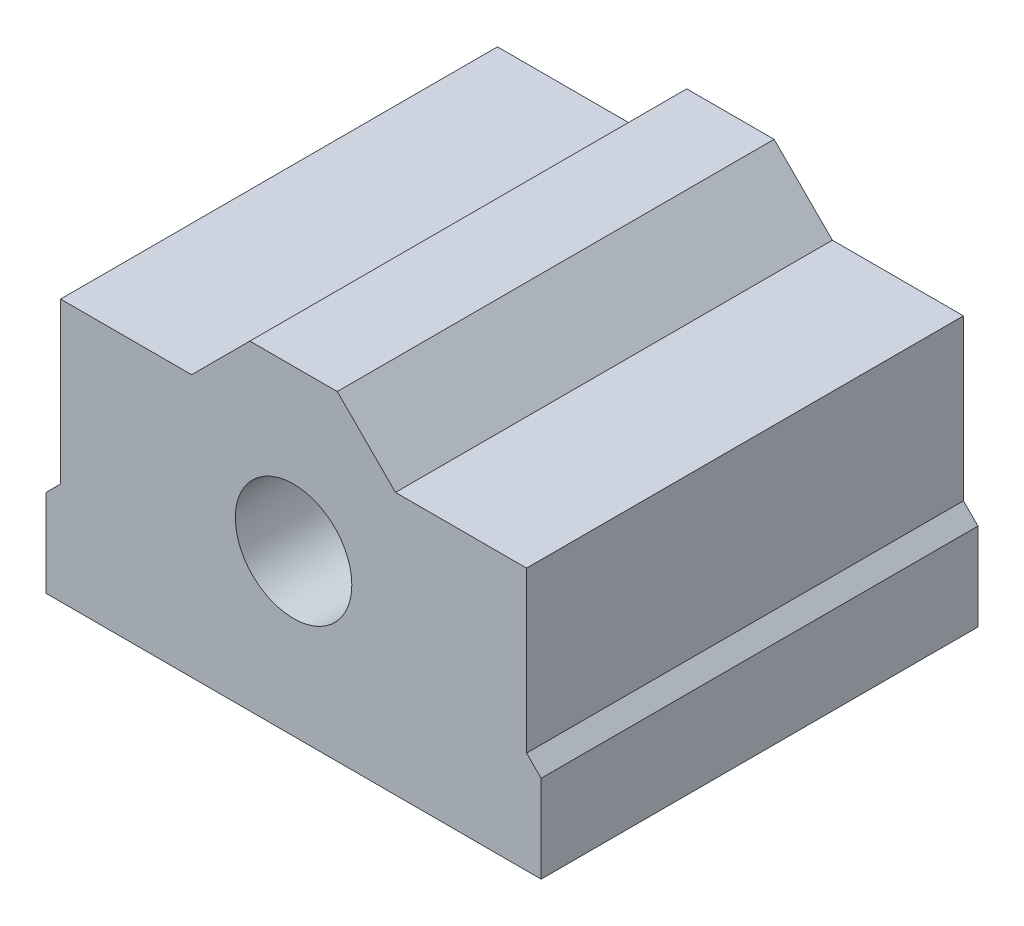
ISO-10303-21;
HEADER;
FILE_DESCRIPTION(('STEP AP214'),'2;1');
FILE_NAME('part.step','',(''),(''),'','','');
FILE_SCHEMA(('AUTOMOTIVE_DESIGN { 1 0 10303 214 1 1 1 1 }'));
ENDSEC;
DATA;
#1=APPLICATION_CONTEXT('core data for automotive mechanical design processes');
#2=APPLICATION_PROTOCOL_DEFINITION('international standard','automotive_design',2000,#1);
#3=PRODUCT_CONTEXT('',#1,'mechanical');
#4=PRODUCT('Part','Part','',(#3));
#5=PRODUCT_RELATED_PRODUCT_CATEGORY('part','',(#4));
#6=PRODUCT_DEFINITION_FORMATION('','',#4);
#7=PRODUCT_DEFINITION_CONTEXT('part definition',#1,'design');
#8=PRODUCT_DEFINITION('design','',#6,#7);
#9=PRODUCT_DEFINITION_SHAPE('','',#8);
#10=(LENGTH_UNIT() NAMED_UNIT(*) SI_UNIT(.MILLI.,.METRE.));
#11=(NAMED_UNIT(*) PLANE_ANGLE_UNIT() SI_UNIT($,.RADIAN.));
#12=(NAMED_UNIT(*) SI_UNIT($,.STERADIAN.) SOLID_ANGLE_UNIT());
#13=UNCERTAINTY_MEASURE_WITH_UNIT(LENGTH_MEASURE(1.E-05),#10,'distance_accuracy_value','');
#14=(GEOMETRIC_REPRESENTATION_CONTEXT(3) GLOBAL_UNCERTAINTY_ASSIGNED_CONTEXT((#13)) GLOBAL_UNIT_ASSIGNED_CONTEXT((#10,
#11,#12)) REPRESENTATION_CONTEXT('',''));
#15=CARTESIAN_POINT('',(0.,0.,0.));
#16=DIRECTION('',(0.,0.,1.));
#17=DIRECTION('',(1.,0.,0.));
#18=AXIS2_PLACEMENT_3D('',#15,#16,#17);
#19=CARTESIAN_POINT('',(34.,6.00000008940697,0.));
#20=DIRECTION('',(0.707106960310672,0.707106602062377,0.));
#21=DIRECTION('',(-0.707106602062377,0.707106960310672,0.));
#22=AXIS2_PLACEMENT_3D('',#19,#20,#21);
#23=PLANE('',#22);
#24=DIRECTION('',(-0.707106602062377,0.707106960310672,0.));
#25=VECTOR('',#24,1.);
#26=CARTESIAN_POINT('',(34.,6.00000008940697,30.));
#27=LINE('',#26,#25);
#28=CARTESIAN_POINT('',(33.0000004917383,7.00000010430813,30.));
#29=VERTEX_POINT('',#28);
#30=CARTESIAN_POINT('',(34.,6.00000008940697,30.));
#31=VERTEX_POINT('',#30);
#32=EDGE_CURVE('E168',#29,#31,#27,.F.);
#33=ORIENTED_EDGE('',*,*,#32,.T.);
#34=DIRECTION('',(0.,0.,-1.));
#35=VECTOR('',#34,1.);
#36=CARTESIAN_POINT('',(34.,6.00000008940697,0.));
#37=LINE('',#36,#35);
#38=CARTESIAN_POINT('',(34.,6.00000008940697,0.));
#39=VERTEX_POINT('',#38);
#40=EDGE_CURVE('E242',#39,#31,#37,.F.);
#41=ORIENTED_EDGE('',*,*,#40,.F.);
#42=DIRECTION('',(-0.707106602062385,0.707106960310665,0.));
#43=VECTOR('',#42,1.);
#44=CARTESIAN_POINT('',(34.,6.00000008940697,0.));
#45=LINE('',#44,#43);
#46=CARTESIAN_POINT('',(33.0000004917383,7.00000010430813,0.));
#47=VERTEX_POINT('',#46);
#48=EDGE_CURVE('E190',#39,#47,#45,.T.);
#49=ORIENTED_EDGE('',*,*,#48,.T.);
#50=DIRECTION('',(0.,0.,-1.));
#51=VECTOR('',#50,1.);
#52=CARTESIAN_POINT('',(33.0000004917383,7.00000010430813,0.));
#53=LINE('',#52,#51);
#54=EDGE_CURVE('E165',#29,#47,#53,.T.);
#55=ORIENTED_EDGE('',*,*,#54,.F.);
#56=EDGE_LOOP('',(#33,#41,#49,#55));
#57=FACE_BOUND('',#56,.T.);
#58=ADVANCED_FACE('F35',(#57),#23,.T.);
#59=CARTESIAN_POINT('',(33.0000004917383,7.00000010430813,0.));
#60=DIRECTION('',(1.,0.,0.));
#61=DIRECTION('',(0.,0.,-1.));
#62=AXIS2_PLACEMENT_3D('',#59,#60,#61);
#63=PLANE('',#62);
#64=DIRECTION('',(0.,1.,0.));
#65=VECTOR('',#64,1.);
#66=CARTESIAN_POINT('',(33.0000004917383,11.0000001639128,30.));
#67=LINE('',#66,#65);
#68=CARTESIAN_POINT('',(33.0000004917383,18.0000002682209,30.));
#69=VERTEX_POINT('',#68);
#70=EDGE_CURVE('E238',#29,#69,#67,.T.);
#71=ORIENTED_EDGE('',*,*,#70,.F.);
#72=ORIENTED_EDGE('',*,*,#54,.T.);
#73=DIRECTION('',(0.,1.,0.));
#74=VECTOR('',#73,1.);
#75=CARTESIAN_POINT('',(33.0000004917383,11.0000001639128,0.));
#76=LINE('',#75,#74);
#77=CARTESIAN_POINT('',(33.0000004917383,18.0000002682209,0.));
#78=VERTEX_POINT('',#77);
#79=EDGE_CURVE('E194',#47,#78,#76,.T.);
#80=ORIENTED_EDGE('',*,*,#79,.T.);
#81=DIRECTION('',(0.,0.,1.));
#82=VECTOR('',#81,1.);
#83=CARTESIAN_POINT('',(33.0000004917383,18.0000002682209,0.));
#84=LINE('',#83,#82);
#85=EDGE_CURVE('E121',#69,#78,#84,.F.);
#86=ORIENTED_EDGE('',*,*,#85,.F.);
#87=EDGE_LOOP('',(#71,#72,#80,#86));
#88=FACE_BOUND('',#87,.T.);
#89=ADVANCED_FACE('F253',(#88),#63,.T.);
#90=CARTESIAN_POINT('',(33.0000004917383,18.0000002682209,0.));
#91=DIRECTION('',(-2.98023218942629E-08,1.,0.));
#92=DIRECTION('',(-1.,-2.98023218942629E-08,0.));
#93=AXIS2_PLACEMENT_3D('',#90,#91,#92);
#94=PLANE('',#93);
#95=DIRECTION('',(1.,0.,0.));
#96=VECTOR('',#95,1.);
#97=CARTESIAN_POINT('',(17.,18.0000002682209,30.));
#98=LINE('',#97,#96);
#99=CARTESIAN_POINT('',(24.0000002905727,18.0000000670552,30.));
#100=VERTEX_POINT('',#99);
#101=EDGE_CURVE('E237',#69,#100,#98,.F.);
#102=ORIENTED_EDGE('',*,*,#101,.F.);
#103=ORIENTED_EDGE('',*,*,#85,.T.);
#104=DIRECTION('',(1.,0.,0.));
#105=VECTOR('',#104,1.);
#106=CARTESIAN_POINT('',(17.,18.0000002682209,0.));
#107=LINE('',#106,#105);
#108=CARTESIAN_POINT('',(24.0000002905727,18.0000000670552,0.));
#109=VERTEX_POINT('',#108);
#110=EDGE_CURVE('E124',#78,#109,#107,.F.);
#111=ORIENTED_EDGE('',*,*,#110,.T.);
#112=DIRECTION('',(0.,0.,1.));
#113=VECTOR('',#112,1.);
#114=CARTESIAN_POINT('',(24.0000003576279,18.,0.));
#115=LINE('',#114,#113);
#116=EDGE_CURVE('E127',#100,#109,#115,.F.);
#117=ORIENTED_EDGE('',*,*,#116,.F.);
#118=EDGE_LOOP('',(#102,#103,#111,#117));
#119=FACE_BOUND('',#118,.T.);
#120=ADVANCED_FACE('F126',(#119),#94,.T.);
#121=CARTESIAN_POINT('',(24.0000003576279,18.,0.));
#122=DIRECTION('',(0.707106757478946,0.707106804894148,0.));
#123=DIRECTION('',(-0.707106804894148,0.707106757478946,0.));
#124=AXIS2_PLACEMENT_3D('',#121,#122,#123);
#125=PLANE('',#124);
#126=DIRECTION('',(-0.707106804894156,0.707106757478939,0.));
#127=VECTOR('',#126,1.);
#128=CARTESIAN_POINT('',(24.0000003576279,18.,30.));
#129=LINE('',#128,#127);
#130=CARTESIAN_POINT('',(19.9999997615814,22.0000003278255,30.));
#131=VERTEX_POINT('',#130);
#132=EDGE_CURVE('E139',#100,#131,#129,.T.);
#133=ORIENTED_EDGE('',*,*,#132,.F.);
#134=ORIENTED_EDGE('',*,*,#116,.T.);
#135=DIRECTION('',(-0.707106804894156,0.707106757478939,0.));
#136=VECTOR('',#135,1.);
#137=CARTESIAN_POINT('',(24.0000003576279,18.,0.));
#138=LINE('',#137,#136);
#139=CARTESIAN_POINT('',(19.9999997615814,22.0000003278255,0.));
#140=VERTEX_POINT('',#139);
#141=EDGE_CURVE('E132',#109,#140,#138,.T.);
#142=ORIENTED_EDGE('',*,*,#141,.T.);
#143=DIRECTION('',(0.,0.,1.));
#144=VECTOR('',#143,1.);
#145=CARTESIAN_POINT('',(19.9999997615814,22.0000003278255,0.));
#146=LINE('',#145,#144);
#147=EDGE_CURVE('E141',#131,#140,#146,.F.);
#148=ORIENTED_EDGE('',*,*,#147,.F.);
#149=EDGE_LOOP('',(#133,#134,#142,#148));
#150=FACE_BOUND('',#149,.T.);
#151=ADVANCED_FACE('F136',(#150),#125,.T.);
#152=CARTESIAN_POINT('',(19.9999997615814,22.0000003278255,0.));
#153=DIRECTION('',(0.,1.,0.));
#154=DIRECTION('',(0.,0.,1.));
#155=AXIS2_PLACEMENT_3D('',#152,#153,#154);
#156=PLANE('',#155);
#157=DIRECTION('',(1.,0.,0.));
#158=VECTOR('',#157,1.);
#159=CARTESIAN_POINT('',(17.,22.0000003278255,30.));
#160=LINE('',#159,#158);
#161=CARTESIAN_POINT('',(14.0000002086163,22.0000003278255,30.));
#162=VERTEX_POINT('',#161);
#163=EDGE_CURVE('E230',#131,#162,#160,.F.);
#164=ORIENTED_EDGE('',*,*,#163,.F.);
#165=ORIENTED_EDGE('',*,*,#147,.T.);
#166=DIRECTION('',(1.,0.,0.));
#167=VECTOR('',#166,1.);
#168=CARTESIAN_POINT('',(17.,22.0000003278255,0.));
#169=LINE('',#168,#167);
#170=CARTESIAN_POINT('',(14.0000002086163,22.0000003278255,0.));
#171=VERTEX_POINT('',#170);
#172=EDGE_CURVE('E146',#140,#171,#169,.F.);
#173=ORIENTED_EDGE('',*,*,#172,.T.);
#174=DIRECTION('',(0.,0.,1.));
#175=VECTOR('',#174,1.);
#176=CARTESIAN_POINT('',(14.0000002086163,22.0000003278255,0.));
#177=LINE('',#176,#175);
#178=EDGE_CURVE('E160',#162,#171,#177,.F.);
#179=ORIENTED_EDGE('',*,*,#178,.F.);
#180=EDGE_LOOP('',(#164,#165,#173,#179));
#181=FACE_BOUND('',#180,.T.);
#182=ADVANCED_FACE('F300',(#181),#156,.T.);
#183=CARTESIAN_POINT('',(14.0000002086163,22.0000003278255,0.));
#184=DIRECTION('',(-0.707106804894148,0.707106757478946,0.));
#185=DIRECTION('',(-0.707106757478946,-0.707106804894148,0.));
#186=AXIS2_PLACEMENT_3D('',#183,#184,#185);
#187=PLANE('',#186);
#188=DIRECTION('',(-0.707106757478955,-0.707106804894139,0.));
#189=VECTOR('',#188,1.);
#190=CARTESIAN_POINT('',(14.0000002086163,22.0000003278255,30.));
#191=LINE('',#190,#189);
#192=CARTESIAN_POINT('',(10.0000001490116,18.,30.));
#193=VERTEX_POINT('',#192);
#194=EDGE_CURVE('E225',#162,#193,#191,.T.);
#195=ORIENTED_EDGE('',*,*,#194,.F.);
#196=ORIENTED_EDGE('',*,*,#178,.T.);
#197=DIRECTION('',(-0.707106757478955,-0.707106804894139,0.));
#198=VECTOR('',#197,1.);
#199=CARTESIAN_POINT('',(14.0000002086163,22.0000003278255,0.));
#200=LINE('',#199,#198);
#201=CARTESIAN_POINT('',(10.0000001490116,18.,0.));
#202=VERTEX_POINT('',#201);
#203=EDGE_CURVE('E148',#171,#202,#200,.T.);
#204=ORIENTED_EDGE('',*,*,#203,.T.);
#205=DIRECTION('',(0.,0.,1.));
#206=VECTOR('',#205,1.);
#207=CARTESIAN_POINT('',(10.0000001490116,18.,0.));
#208=LINE('',#207,#206);
#209=EDGE_CURVE('E157',#193,#202,#208,.F.);
#210=ORIENTED_EDGE('',*,*,#209,.F.);
#211=EDGE_LOOP('',(#195,#196,#204,#210));
#212=FACE_BOUND('',#211,.T.);
#213=ADVANCED_FACE('F203',(#212),#187,.T.);
#214=CARTESIAN_POINT('',(10.0000001490116,18.,0.));
#215=DIRECTION('',(2.98023218942629E-08,1.,0.));
#216=DIRECTION('',(-1.,2.98023218942629E-08,0.));
#217=AXIS2_PLACEMENT_3D('',#214,#215,#216);
#218=PLANE('',#217);
#219=DIRECTION('',(1.,0.,0.));
#220=VECTOR('',#219,1.);
#221=CARTESIAN_POINT('',(17.,18.,30.));
#222=LINE('',#221,#220);
#223=CARTESIAN_POINT('',(1.00000001490116,18.0000002011657,30.));
#224=VERTEX_POINT('',#223);
#225=EDGE_CURVE('E209',#193,#224,#222,.F.);
#226=ORIENTED_EDGE('',*,*,#225,.F.);
#227=ORIENTED_EDGE('',*,*,#209,.T.);
#228=DIRECTION('',(1.,0.,0.));
#229=VECTOR('',#228,1.);
#230=CARTESIAN_POINT('',(17.,18.,0.));
#231=LINE('',#230,#229);
#232=CARTESIAN_POINT('',(1.00000001490116,18.0000002011657,0.));
#233=VERTEX_POINT('',#232);
#234=EDGE_CURVE('E200',#202,#233,#231,.F.);
#235=ORIENTED_EDGE('',*,*,#234,.T.);
#236=DIRECTION('',(0.,0.,1.));
#237=VECTOR('',#236,1.);
#238=CARTESIAN_POINT('',(1.00000001490116,18.0000002682209,0.));
#239=LINE('',#238,#237);
#240=EDGE_CURVE('E154',#224,#233,#239,.F.);
#241=ORIENTED_EDGE('',*,*,#240,.F.);
#242=EDGE_LOOP('',(#226,#227,#235,#241));
#243=FACE_BOUND('',#242,.T.);
#244=ADVANCED_FACE('F207',(#243),#218,.T.);
#245=CARTESIAN_POINT('',(1.00000001490116,18.0000002682209,0.));
#246=DIRECTION('',(-1.,0.,0.));
#247=DIRECTION('',(0.,0.,1.));
#248=AXIS2_PLACEMENT_3D('',#245,#246,#247);
#249=PLANE('',#248);
#250=DIRECTION('',(0.,1.,0.));
#251=VECTOR('',#250,1.);
#252=CARTESIAN_POINT('',(1.00000001490116,11.0000001639128,30.));
#253=LINE('',#252,#251);
#254=CARTESIAN_POINT('',(1.00000001490116,7.00000010430813,30.));
#255=VERTEX_POINT('',#254);
#256=EDGE_CURVE('E181',#224,#255,#253,.F.);
#257=ORIENTED_EDGE('',*,*,#256,.F.);
#258=ORIENTED_EDGE('',*,*,#240,.T.);
#259=DIRECTION('',(0.,1.,0.));
#260=VECTOR('',#259,1.);
#261=CARTESIAN_POINT('',(1.00000001490116,11.0000001639128,0.));
#262=LINE('',#261,#260);
#263=CARTESIAN_POINT('',(1.00000001490116,7.00000010430813,0.));
#264=VERTEX_POINT('',#263);
#265=EDGE_CURVE('E198',#233,#264,#262,.F.);
#266=ORIENTED_EDGE('',*,*,#265,.T.);
#267=DIRECTION('',(0.,0.,1.));
#268=VECTOR('',#267,1.);
#269=CARTESIAN_POINT('',(1.00000001490116,7.00000010430813,0.));
#270=LINE('',#269,#268);
#271=EDGE_CURVE('E133',#255,#264,#270,.F.);
#272=ORIENTED_EDGE('',*,*,#271,.F.);
#273=EDGE_LOOP('',(#257,#258,#266,#272));
#274=FACE_BOUND('',#273,.T.);
#275=ADVANCED_FACE('F216',(#274),#249,.T.);
#276=CARTESIAN_POINT('',(17.,11.,0.));
#277=DIRECTION('',(0.,0.,1.));
#278=DIRECTION('',(1.,0.,0.));
#279=AXIS2_PLACEMENT_3D('',#276,#277,#278);
#280=CYLINDRICAL_SURFACE('',#279,4.);
#281=CARTESIAN_POINT('',(17.,11.,0.));
#282=DIRECTION('',(0.,0.,1.));
#283=DIRECTION('',(1.,0.,0.));
#284=AXIS2_PLACEMENT_3D('',#281,#282,#283);
#285=CIRCLE('',#284,4.);
#286=CARTESIAN_POINT('',(21.,11.,0.));
#287=VERTEX_POINT('',#286);
#288=EDGE_CURVE('E38',#287,#287,#285,.F.);
#289=ORIENTED_EDGE('',*,*,#288,.T.);
#290=EDGE_LOOP('',(#289));
#291=FACE_BOUND('',#290,.T.);
#292=CARTESIAN_POINT('',(17.,11.,30.));
#293=DIRECTION('',(0.,0.,1.));
#294=DIRECTION('',(1.,0.,0.));
#295=AXIS2_PLACEMENT_3D('',#292,#293,#294);
#296=CIRCLE('',#295,4.);
#297=CARTESIAN_POINT('',(21.,11.,30.));
#298=VERTEX_POINT('',#297);
#299=EDGE_CURVE('E170',#298,#298,#296,.F.);
#300=ORIENTED_EDGE('',*,*,#299,.F.);
#301=EDGE_LOOP('',(#300));
#302=FACE_BOUND('',#301,.T.);
#303=ADVANCED_FACE('F291',(#291,#302),#280,.F.);
#304=CARTESIAN_POINT('',(1.00000001490116,7.00000010430813,0.));
#305=DIRECTION('',(-0.707106781186548,0.707106781186548,0.));
#306=DIRECTION('',(-0.707106781186548,-0.707106781186548,0.));
#307=AXIS2_PLACEMENT_3D('',#304,#305,#306);
#308=PLANE('',#307);
#309=DIRECTION('',(-0.707106781186548,-0.707106781186547,0.));
#310=VECTOR('',#309,1.);
#311=CARTESIAN_POINT('',(1.00000001490116,7.00000010430813,30.));
#312=LINE('',#311,#310);
#313=CARTESIAN_POINT('',(0.,6.00000008940697,30.));
#314=VERTEX_POINT('',#313);
#315=EDGE_CURVE('E179',#255,#314,#312,.T.);
#316=ORIENTED_EDGE('',*,*,#315,.F.);
#317=ORIENTED_EDGE('',*,*,#271,.T.);
#318=DIRECTION('',(-0.707106781186548,-0.707106781186547,0.));
#319=VECTOR('',#318,1.);
#320=CARTESIAN_POINT('',(1.00000001490116,7.00000010430813,0.));
#321=LINE('',#320,#319);
#322=CARTESIAN_POINT('',(0.,6.00000008940697,0.));
#323=VERTEX_POINT('',#322);
#324=EDGE_CURVE('E195',#264,#323,#321,.T.);
#325=ORIENTED_EDGE('',*,*,#324,.T.);
#326=DIRECTION('',(0.,0.,1.));
#327=VECTOR('',#326,1.);
#328=CARTESIAN_POINT('',(0.,6.00000008940697,0.));
#329=LINE('',#328,#327);
#330=EDGE_CURVE('E223',#314,#323,#329,.F.);
#331=ORIENTED_EDGE('',*,*,#330,.F.);
#332=EDGE_LOOP('',(#316,#317,#325,#331));
#333=FACE_BOUND('',#332,.T.);
#334=ADVANCED_FACE('F219',(#333),#308,.T.);
#335=CARTESIAN_POINT('',(17.,11.0000001639128,0.));
#336=DIRECTION('',(0.,0.,1.));
#337=DIRECTION('',(1.,0.,0.));
#338=AXIS2_PLACEMENT_3D('',#335,#336,#337);
#339=PLANE('',#338);
#340=ORIENTED_EDGE('',*,*,#288,.F.);
#341=EDGE_LOOP('',(#340));
#342=FACE_BOUND('',#341,.T.);
#343=ORIENTED_EDGE('',*,*,#48,.F.);
#344=DIRECTION('',(0.,1.,0.));
#345=VECTOR('',#344,1.);
#346=CARTESIAN_POINT('',(34.,0.,0.));
#347=LINE('',#346,#345);
#348=CARTESIAN_POINT('',(34.,0.,0.));
#349=VERTEX_POINT('',#348);
#350=EDGE_CURVE('E244',#349,#39,#347,.T.);
#351=ORIENTED_EDGE('',*,*,#350,.F.);
#352=DIRECTION('',(1.,0.,0.));
#353=VECTOR('',#352,1.);
#354=CARTESIAN_POINT('',(0.,0.,0.));
#355=LINE('',#354,#353);
#356=CARTESIAN_POINT('',(0.,0.,0.));
#357=VERTEX_POINT('',#356);
#358=EDGE_CURVE('E265',#357,#349,#355,.T.);
#359=ORIENTED_EDGE('',*,*,#358,.F.);
#360=DIRECTION('',(0.,1.,0.));
#361=VECTOR('',#360,1.);
#362=CARTESIAN_POINT('',(0.,6.00000008940697,0.));
#363=LINE('',#362,#361);
#364=EDGE_CURVE('E172',#323,#357,#363,.F.);
#365=ORIENTED_EDGE('',*,*,#364,.F.);
#366=ORIENTED_EDGE('',*,*,#324,.F.);
#367=ORIENTED_EDGE('',*,*,#265,.F.);
#368=ORIENTED_EDGE('',*,*,#234,.F.);
#369=ORIENTED_EDGE('',*,*,#203,.F.);
#370=ORIENTED_EDGE('',*,*,#172,.F.);
#371=ORIENTED_EDGE('',*,*,#141,.F.);
#372=ORIENTED_EDGE('',*,*,#110,.F.);
#373=ORIENTED_EDGE('',*,*,#79,.F.);
#374=EDGE_LOOP('',(#343,#351,#359,#365,#366,#367,#368,#369,#370,#371,#372,#373));
#375=FACE_BOUND('',#374,.T.);
#376=ADVANCED_FACE('F144',(#342,#375),#339,.F.);
#377=CARTESIAN_POINT('',(34.,0.,0.));
#378=DIRECTION('',(1.,0.,0.));
#379=DIRECTION('',(0.,0.,-1.));
#380=AXIS2_PLACEMENT_3D('',#377,#378,#379);
#381=PLANE('',#380);
#382=DIRECTION('',(0.,1.,0.));
#383=VECTOR('',#382,1.);
#384=CARTESIAN_POINT('',(34.,11.0000001639128,30.));
#385=LINE('',#384,#383);
#386=CARTESIAN_POINT('',(34.,0.,30.));
#387=VERTEX_POINT('',#386);
#388=EDGE_CURVE('E173',#387,#31,#385,.T.);
#389=ORIENTED_EDGE('',*,*,#388,.F.);
#390=DIRECTION('',(0.,0.,-1.));
#391=VECTOR('',#390,1.);
#392=CARTESIAN_POINT('',(34.,0.,0.));
#393=LINE('',#392,#391);
#394=EDGE_CURVE('E259',#349,#387,#393,.F.);
#395=ORIENTED_EDGE('',*,*,#394,.F.);
#396=ORIENTED_EDGE('',*,*,#350,.T.);
#397=ORIENTED_EDGE('',*,*,#40,.T.);
#398=EDGE_LOOP('',(#389,#395,#396,#397));
#399=FACE_BOUND('',#398,.T.);
#400=ADVANCED_FACE('F257',(#399),#381,.T.);
#401=CARTESIAN_POINT('',(17.,11.0000001639128,30.));
#402=DIRECTION('',(0.,0.,1.));
#403=DIRECTION('',(1.,0.,0.));
#404=AXIS2_PLACEMENT_3D('',#401,#402,#403);
#405=PLANE('',#404);
#406=ORIENTED_EDGE('',*,*,#299,.T.);
#407=EDGE_LOOP('',(#406));
#408=FACE_BOUND('',#407,.T.);
#409=ORIENTED_EDGE('',*,*,#388,.T.);
#410=ORIENTED_EDGE('',*,*,#32,.F.);
#411=ORIENTED_EDGE('',*,*,#70,.T.);
#412=ORIENTED_EDGE('',*,*,#101,.T.);
#413=ORIENTED_EDGE('',*,*,#132,.T.);
#414=ORIENTED_EDGE('',*,*,#163,.T.);
#415=ORIENTED_EDGE('',*,*,#194,.T.);
#416=ORIENTED_EDGE('',*,*,#225,.T.);
#417=ORIENTED_EDGE('',*,*,#256,.T.);
#418=ORIENTED_EDGE('',*,*,#315,.T.);
#419=DIRECTION('',(0.,1.,0.));
#420=VECTOR('',#419,1.);
#421=CARTESIAN_POINT('',(0.,6.00000008940697,30.));
#422=LINE('',#421,#420);
#423=CARTESIAN_POINT('',(0.,0.,30.));
#424=VERTEX_POINT('',#423);
#425=EDGE_CURVE('E53',#424,#314,#422,.T.);
#426=ORIENTED_EDGE('',*,*,#425,.F.);
#427=DIRECTION('',(1.,0.,0.));
#428=VECTOR('',#427,1.);
#429=CARTESIAN_POINT('',(0.,0.,30.));
#430=LINE('',#429,#428);
#431=EDGE_CURVE('E44',#387,#424,#430,.F.);
#432=ORIENTED_EDGE('',*,*,#431,.F.);
#433=EDGE_LOOP('',(#409,#410,#411,#412,#413,#414,#415,#416,#417,#418,#426,#432));
#434=FACE_BOUND('',#433,.T.);
#435=ADVANCED_FACE('F224',(#408,#434),#405,.T.);
#436=CARTESIAN_POINT('',(0.,6.00000008940697,0.));
#437=DIRECTION('',(-1.,0.,0.));
#438=DIRECTION('',(0.,0.,1.));
#439=AXIS2_PLACEMENT_3D('',#436,#437,#438);
#440=PLANE('',#439);
#441=ORIENTED_EDGE('',*,*,#425,.T.);
#442=ORIENTED_EDGE('',*,*,#330,.T.);
#443=ORIENTED_EDGE('',*,*,#364,.T.);
#444=DIRECTION('',(0.,0.,-1.));
#445=VECTOR('',#444,1.);
#446=CARTESIAN_POINT('',(0.,0.,0.));
#447=LINE('',#446,#445);
#448=EDGE_CURVE('E12',#424,#357,#447,.T.);
#449=ORIENTED_EDGE('',*,*,#448,.F.);
#450=EDGE_LOOP('',(#441,#442,#443,#449));
#451=FACE_BOUND('',#450,.T.);
#452=ADVANCED_FACE('F271',(#451),#440,.T.);
#453=CARTESIAN_POINT('',(0.,0.,0.));
#454=DIRECTION('',(0.,-1.,0.));
#455=DIRECTION('',(0.,0.,-1.));
#456=AXIS2_PLACEMENT_3D('',#453,#454,#455);
#457=PLANE('',#456);
#458=CARTESIAN_POINT('',(5.00000000000006,0.,6.2));
#459=DIRECTION('',(0.,-1.,0.));
#460=DIRECTION('',(0.,0.,-1.));
#461=AXIS2_PLACEMENT_3D('',#458,#459,#460);
#462=CIRCLE('',#461,2.);
#463=CARTESIAN_POINT('',(5.00000000000006,0.,4.2));
#464=VERTEX_POINT('',#463);
#465=EDGE_CURVE('E369',#464,#464,#462,.T.);
#466=ORIENTED_EDGE('',*,*,#465,.F.);
#467=EDGE_LOOP('',(#466));
#468=FACE_BOUND('',#467,.T.);
#469=CARTESIAN_POINT('',(29.,0.,6.2));
#470=DIRECTION('',(0.,-1.,0.));
#471=DIRECTION('',(0.,0.,-1.));
#472=AXIS2_PLACEMENT_3D('',#469,#470,#471);
#473=CIRCLE('',#472,2.);
#474=CARTESIAN_POINT('',(29.,0.,4.2));
#475=VERTEX_POINT('',#474);
#476=EDGE_CURVE('E363',#475,#475,#473,.T.);
#477=ORIENTED_EDGE('',*,*,#476,.F.);
#478=EDGE_LOOP('',(#477));
#479=FACE_BOUND('',#478,.T.);
#480=CARTESIAN_POINT('',(28.9999999999999,0.,23.8));
#481=DIRECTION('',(0.,-1.,0.));
#482=DIRECTION('',(0.,0.,-1.));
#483=AXIS2_PLACEMENT_3D('',#480,#481,#482);
#484=CIRCLE('',#483,2.);
#485=CARTESIAN_POINT('',(28.9999999999999,0.,21.8));
#486=VERTEX_POINT('',#485);
#487=EDGE_CURVE('E353',#486,#486,#484,.T.);
#488=ORIENTED_EDGE('',*,*,#487,.F.);
#489=EDGE_LOOP('',(#488));
#490=FACE_BOUND('',#489,.T.);
#491=CARTESIAN_POINT('',(5.,0.,23.8));
#492=DIRECTION('',(0.,-1.,0.));
#493=DIRECTION('',(0.,0.,-1.));
#494=AXIS2_PLACEMENT_3D('',#491,#492,#493);
#495=CIRCLE('',#494,2.);
#496=CARTESIAN_POINT('',(5.,0.,21.8));
#497=VERTEX_POINT('',#496);
#498=EDGE_CURVE('E352',#497,#497,#495,.T.);
#499=ORIENTED_EDGE('',*,*,#498,.F.);
#500=EDGE_LOOP('',(#499));
#501=FACE_BOUND('',#500,.T.);
#502=ORIENTED_EDGE('',*,*,#431,.T.);
#503=ORIENTED_EDGE('',*,*,#448,.T.);
#504=ORIENTED_EDGE('',*,*,#358,.T.);
#505=ORIENTED_EDGE('',*,*,#394,.T.);
#506=EDGE_LOOP('',(#502,#503,#504,#505));
#507=FACE_BOUND('',#506,.T.);
#508=ADVANCED_FACE('F264',(#468,#479,#490,#501,#507),#457,.T.);
#509=CARTESIAN_POINT('',(5.,3.,23.8));
#510=DIRECTION('',(0.,-1.,0.));
#511=DIRECTION('',(0.,0.,-1.));
#512=AXIS2_PLACEMENT_3D('',#509,#510,#511);
#513=CYLINDRICAL_SURFACE('',#512,2.);
#514=CARTESIAN_POINT('',(5.,3.,23.8));
#515=DIRECTION('',(0.,-1.,0.));
#516=DIRECTION('',(0.,0.,-1.));
#517=AXIS2_PLACEMENT_3D('',#514,#515,#516);
#518=CIRCLE('',#517,2.);
#519=CARTESIAN_POINT('',(5.,3.,21.8));
#520=VERTEX_POINT('',#519);
#521=EDGE_CURVE('E169',#520,#520,#518,.T.);
#522=ORIENTED_EDGE('',*,*,#521,.F.);
#523=EDGE_LOOP('',(#522));
#524=FACE_BOUND('',#523,.T.);
#525=ORIENTED_EDGE('',*,*,#498,.T.);
#526=EDGE_LOOP('',(#525));
#527=FACE_BOUND('',#526,.T.);
#528=ADVANCED_FACE('F278',(#524,#527),#513,.F.);
#529=CARTESIAN_POINT('',(5.,3.,23.8));
#530=DIRECTION('',(0.,-1.,0.));
#531=DIRECTION('',(0.,0.,-1.));
#532=AXIS2_PLACEMENT_3D('',#529,#530,#531);
#533=PLANE('',#532);
#534=ORIENTED_EDGE('',*,*,#521,.T.);
#535=EDGE_LOOP('',(#534));
#536=FACE_BOUND('',#535,.T.);
#537=ADVANCED_FACE('F314',(#536),#533,.T.);
#538=CARTESIAN_POINT('',(28.9999999999999,3.,23.8));
#539=DIRECTION('',(0.,-1.,0.));
#540=DIRECTION('',(0.,0.,-1.));
#541=AXIS2_PLACEMENT_3D('',#538,#539,#540);
#542=CYLINDRICAL_SURFACE('',#541,2.);
#543=CARTESIAN_POINT('',(28.9999999999999,3.,23.8));
#544=DIRECTION('',(0.,-1.,0.));
#545=DIRECTION('',(0.,0.,-1.));
#546=AXIS2_PLACEMENT_3D('',#543,#544,#545);
#547=CIRCLE('',#546,2.);
#548=CARTESIAN_POINT('',(28.9999999999999,3.,21.8));
#549=VERTEX_POINT('',#548);
#550=EDGE_CURVE('E351',#549,#549,#547,.T.);
#551=ORIENTED_EDGE('',*,*,#550,.F.);
#552=EDGE_LOOP('',(#551));
#553=FACE_BOUND('',#552,.T.);
#554=ORIENTED_EDGE('',*,*,#487,.T.);
#555=EDGE_LOOP('',(#554));
#556=FACE_BOUND('',#555,.T.);
#557=ADVANCED_FACE('F319',(#553,#556),#542,.F.);
#558=CARTESIAN_POINT('',(28.9999999999999,3.,23.8));
#559=DIRECTION('',(0.,-1.,0.));
#560=DIRECTION('',(0.,0.,-1.));
#561=AXIS2_PLACEMENT_3D('',#558,#559,#560);
#562=PLANE('',#561);
#563=ORIENTED_EDGE('',*,*,#550,.T.);
#564=EDGE_LOOP('',(#563));
#565=FACE_BOUND('',#564,.T.);
#566=ADVANCED_FACE('F337',(#565),#562,.T.);
#567=CARTESIAN_POINT('',(29.,3.,6.2));
#568=DIRECTION('',(0.,-1.,0.));
#569=DIRECTION('',(0.,0.,-1.));
#570=AXIS2_PLACEMENT_3D('',#567,#568,#569);
#571=CYLINDRICAL_SURFACE('',#570,2.);
#572=CARTESIAN_POINT('',(29.,3.,6.2));
#573=DIRECTION('',(0.,-1.,0.));
#574=DIRECTION('',(0.,0.,-1.));
#575=AXIS2_PLACEMENT_3D('',#572,#573,#574);
#576=CIRCLE('',#575,2.);
#577=CARTESIAN_POINT('',(29.,3.,4.2));
#578=VERTEX_POINT('',#577);
#579=EDGE_CURVE('E358',#578,#578,#576,.T.);
#580=ORIENTED_EDGE('',*,*,#579,.F.);
#581=EDGE_LOOP('',(#580));
#582=FACE_BOUND('',#581,.T.);
#583=ORIENTED_EDGE('',*,*,#476,.T.);
#584=EDGE_LOOP('',(#583));
#585=FACE_BOUND('',#584,.T.);
#586=ADVANCED_FACE('F334',(#582,#585),#571,.F.);
#587=CARTESIAN_POINT('',(29.,3.,6.2));
#588=DIRECTION('',(0.,-1.,0.));
#589=DIRECTION('',(0.,0.,-1.));
#590=AXIS2_PLACEMENT_3D('',#587,#588,#589);
#591=PLANE('',#590);
#592=ORIENTED_EDGE('',*,*,#579,.T.);
#593=EDGE_LOOP('',(#592));
#594=FACE_BOUND('',#593,.T.);
#595=ADVANCED_FACE('F329',(#594),#591,.T.);
#596=CARTESIAN_POINT('',(5.00000000000006,3.,6.2));
#597=DIRECTION('',(0.,-1.,0.));
#598=DIRECTION('',(0.,0.,-1.));
#599=AXIS2_PLACEMENT_3D('',#596,#597,#598);
#600=CYLINDRICAL_SURFACE('',#599,2.);
#601=CARTESIAN_POINT('',(5.00000000000006,3.,6.2));
#602=DIRECTION('',(0.,-1.,0.));
#603=DIRECTION('',(0.,0.,-1.));
#604=AXIS2_PLACEMENT_3D('',#601,#602,#603);
#605=CIRCLE('',#604,2.);
#606=CARTESIAN_POINT('',(5.00000000000006,3.,4.2));
#607=VERTEX_POINT('',#606);
#608=EDGE_CURVE('E366',#607,#607,#605,.T.);
#609=ORIENTED_EDGE('',*,*,#608,.F.);
#610=EDGE_LOOP('',(#609));
#611=FACE_BOUND('',#610,.T.);
#612=ORIENTED_EDGE('',*,*,#465,.T.);
#613=EDGE_LOOP('',(#612));
#614=FACE_BOUND('',#613,.T.);
#615=ADVANCED_FACE('F325',(#611,#614),#600,.F.);
#616=CARTESIAN_POINT('',(5.00000000000006,3.,6.2));
#617=DIRECTION('',(0.,-1.,0.));
#618=DIRECTION('',(0.,0.,-1.));
#619=AXIS2_PLACEMENT_3D('',#616,#617,#618);
#620=PLANE('',#619);
#621=ORIENTED_EDGE('',*,*,#608,.T.);
#622=EDGE_LOOP('',(#621));
#623=FACE_BOUND('',#622,.T.);
#624=ADVANCED_FACE('F328',(#623),#620,.T.);
#625=CLOSED_SHELL('',(#58,#89,#120,#151,#182,#213,#244,#275,#303,#334,#376,#400,#435,#452,#508,
#528,#537,#557,#566,#586,#595,#615,#624));
#626=MANIFOLD_SOLID_BREP('B2',#625);
#627=ADVANCED_BREP_SHAPE_REPRESENTATION('',(#18,#626),#14);
#628=SHAPE_DEFINITION_REPRESENTATION(#9,#627);
ENDSEC;
END-ISO-10303-21;
